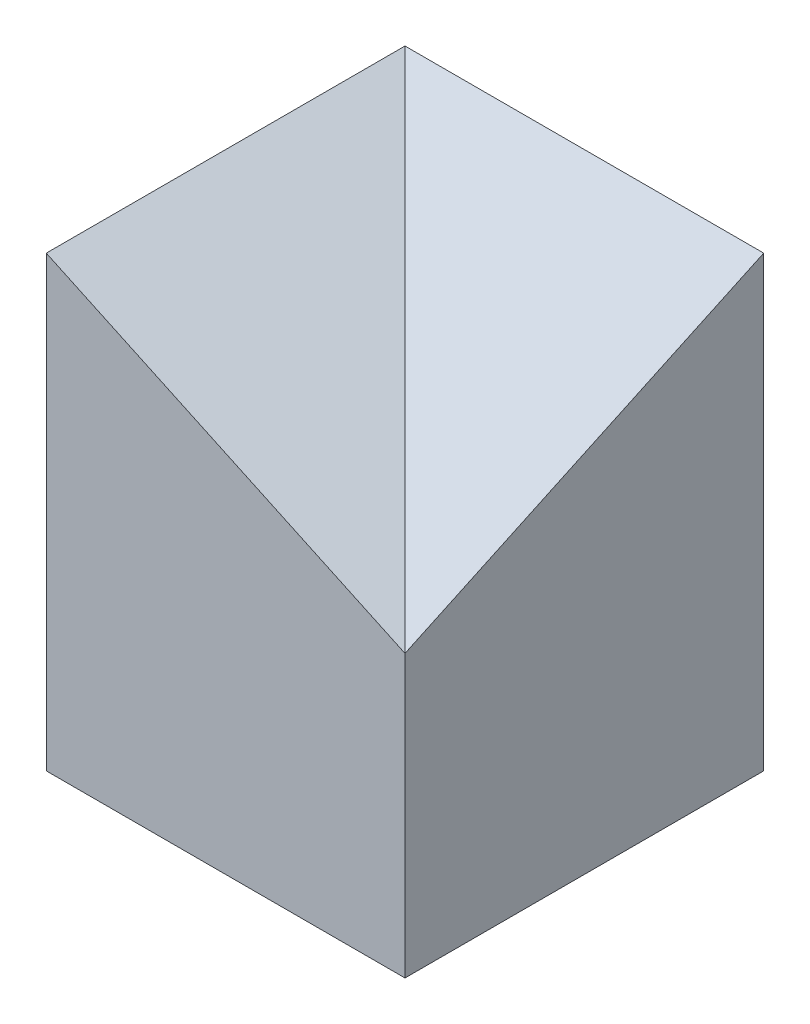
ISO-10303-21;
HEADER;
FILE_DESCRIPTION(('STEP AP214'),'2;1');
FILE_NAME('part.step','',(''),(''),'','','');
FILE_SCHEMA(('AUTOMOTIVE_DESIGN { 1 0 10303 214 1 1 1 1 }'));
ENDSEC;
DATA;
#1=APPLICATION_CONTEXT('core data for automotive mechanical design processes');
#2=APPLICATION_PROTOCOL_DEFINITION('international standard','automotive_design',2000,#1);
#3=PRODUCT_CONTEXT('',#1,'mechanical');
#4=PRODUCT('Part','Part','',(#3));
#5=PRODUCT_RELATED_PRODUCT_CATEGORY('part','',(#4));
#6=PRODUCT_DEFINITION_FORMATION('','',#4);
#7=PRODUCT_DEFINITION_CONTEXT('part definition',#1,'design');
#8=PRODUCT_DEFINITION('design','',#6,#7);
#9=PRODUCT_DEFINITION_SHAPE('','',#8);
#10=(LENGTH_UNIT() NAMED_UNIT(*) SI_UNIT(.MILLI.,.METRE.));
#11=(NAMED_UNIT(*) PLANE_ANGLE_UNIT() SI_UNIT($,.RADIAN.));
#12=(NAMED_UNIT(*) SI_UNIT($,.STERADIAN.) SOLID_ANGLE_UNIT());
#13=UNCERTAINTY_MEASURE_WITH_UNIT(LENGTH_MEASURE(1.E-05),#10,'distance_accuracy_value','');
#14=(GEOMETRIC_REPRESENTATION_CONTEXT(3) GLOBAL_UNCERTAINTY_ASSIGNED_CONTEXT((#13)) GLOBAL_UNIT_ASSIGNED_CONTEXT((#10,
#11,#12)) REPRESENTATION_CONTEXT('',''));
#15=CARTESIAN_POINT('',(0.,0.,0.));
#16=DIRECTION('',(0.,0.,1.));
#17=DIRECTION('',(1.,0.,0.));
#18=AXIS2_PLACEMENT_3D('',#15,#16,#17);
#19=CARTESIAN_POINT('',(400.,500.001,0.));
#20=DIRECTION('',(-1.,0.,0.));
#21=DIRECTION('',(0.,0.,1.));
#22=AXIS2_PLACEMENT_3D('',#19,#20,#21);
#23=PLANE('',#22);
#24=DIRECTION('',(0.,0.422618261740694,-0.906307787036653));
#25=VECTOR('',#24,1.);
#26=CARTESIAN_POINT('',(400.,500.000178606195,-0.000383022221570499));
#27=LINE('',#26,#25);
#28=CARTESIAN_POINT('',(400.,313.476936738004,400.));
#29=VERTEX_POINT('',#28);
#30=CARTESIAN_POINT('',(400.,500.,0.));
#31=VERTEX_POINT('',#30);
#32=EDGE_CURVE('E59',#29,#31,#27,.T.);
#33=ORIENTED_EDGE('',*,*,#32,.F.);
#34=DIRECTION('',(0.,-1.,0.));
#35=VECTOR('',#34,1.);
#36=CARTESIAN_POINT('',(400.,500.001,400.));
#37=LINE('',#36,#35);
#38=CARTESIAN_POINT('',(400.,0.,400.));
#39=VERTEX_POINT('',#38);
#40=EDGE_CURVE('E83',#29,#39,#37,.T.);
#41=ORIENTED_EDGE('',*,*,#40,.T.);
#42=DIRECTION('',(0.,0.,-1.));
#43=VECTOR('',#42,1.);
#44=CARTESIAN_POINT('',(400.,0.,0.));
#45=LINE('',#44,#43);
#46=CARTESIAN_POINT('',(400.,0.,0.));
#47=VERTEX_POINT('',#46);
#48=EDGE_CURVE('E86',#39,#47,#45,.T.);
#49=ORIENTED_EDGE('',*,*,#48,.T.);
#50=DIRECTION('',(0.,-1.,0.));
#51=VECTOR('',#50,1.);
#52=CARTESIAN_POINT('',(400.,500.001,0.));
#53=LINE('',#52,#51);
#54=EDGE_CURVE('E104',#31,#47,#53,.T.);
#55=ORIENTED_EDGE('',*,*,#54,.F.);
#56=EDGE_LOOP('',(#33,#41,#49,#55));
#57=FACE_BOUND('',#56,.T.);
#58=ADVANCED_FACE('F49',(#57),#23,.F.);
#59=CARTESIAN_POINT('',(0.,500.001,0.));
#60=DIRECTION('',(0.,0.,1.));
#61=DIRECTION('',(1.,0.,0.));
#62=AXIS2_PLACEMENT_3D('',#59,#60,#61);
#63=PLANE('',#62);
#64=DIRECTION('',(-1.,0.,0.));
#65=VECTOR('',#64,1.);
#66=CARTESIAN_POINT('',(0.,500.,0.));
#67=LINE('',#66,#65);
#68=CARTESIAN_POINT('',(0.,500.,0.));
#69=VERTEX_POINT('',#68);
#70=EDGE_CURVE('E12',#31,#69,#67,.T.);
#71=ORIENTED_EDGE('',*,*,#70,.F.);
#72=ORIENTED_EDGE('',*,*,#54,.T.);
#73=DIRECTION('',(-1.,0.,0.));
#74=VECTOR('',#73,1.);
#75=CARTESIAN_POINT('',(0.,0.,0.));
#76=LINE('',#75,#74);
#77=CARTESIAN_POINT('',(0.,0.,0.));
#78=VERTEX_POINT('',#77);
#79=EDGE_CURVE('E103',#47,#78,#76,.T.);
#80=ORIENTED_EDGE('',*,*,#79,.T.);
#81=DIRECTION('',(0.,-1.,0.));
#82=VECTOR('',#81,1.);
#83=CARTESIAN_POINT('',(0.,500.001,0.));
#84=LINE('',#83,#82);
#85=EDGE_CURVE('E112',#69,#78,#84,.T.);
#86=ORIENTED_EDGE('',*,*,#85,.F.);
#87=EDGE_LOOP('',(#71,#72,#80,#86));
#88=FACE_BOUND('',#87,.T.);
#89=ADVANCED_FACE('F128',(#88),#63,.F.);
#90=CARTESIAN_POINT('',(0.,500.001,0.));
#91=DIRECTION('',(1.,0.,0.));
#92=DIRECTION('',(0.,0.,-1.));
#93=AXIS2_PLACEMENT_3D('',#90,#91,#92);
#94=PLANE('',#93);
#95=DIRECTION('',(0.,-1.,0.));
#96=VECTOR('',#95,1.);
#97=CARTESIAN_POINT('',(0.,500.001,400.));
#98=LINE('',#97,#96);
#99=CARTESIAN_POINT('',(0.,500.,400.));
#100=VERTEX_POINT('',#99);
#101=CARTESIAN_POINT('',(0.,0.,400.));
#102=VERTEX_POINT('',#101);
#103=EDGE_CURVE('E96',#100,#102,#98,.T.);
#104=ORIENTED_EDGE('',*,*,#103,.F.);
#105=DIRECTION('',(0.,0.,-1.));
#106=VECTOR('',#105,1.);
#107=CARTESIAN_POINT('',(0.,500.,0.));
#108=LINE('',#107,#106);
#109=EDGE_CURVE('E115',#100,#69,#108,.T.);
#110=ORIENTED_EDGE('',*,*,#109,.T.);
#111=ORIENTED_EDGE('',*,*,#85,.T.);
#112=DIRECTION('',(0.,0.,1.));
#113=VECTOR('',#112,1.);
#114=CARTESIAN_POINT('',(0.,0.,0.));
#115=LINE('',#114,#113);
#116=EDGE_CURVE('E109',#78,#102,#115,.T.);
#117=ORIENTED_EDGE('',*,*,#116,.T.);
#118=EDGE_LOOP('',(#104,#110,#111,#117));
#119=FACE_BOUND('',#118,.T.);
#120=ADVANCED_FACE('F126',(#119),#94,.F.);
#121=CARTESIAN_POINT('',(0.,500.001,400.));
#122=DIRECTION('',(0.,0.,-1.));
#123=DIRECTION('',(-1.,0.,0.));
#124=AXIS2_PLACEMENT_3D('',#121,#122,#123);
#125=PLANE('',#124);
#126=ORIENTED_EDGE('',*,*,#40,.F.);
#127=DIRECTION('',(-0.906307787036653,0.422618261740694,0.));
#128=VECTOR('',#127,1.);
#129=CARTESIAN_POINT('',(-0.000383022221532901,500.000178606195,400.));
#130=LINE('',#129,#128);
#131=EDGE_CURVE('E111',#29,#100,#130,.T.);
#132=ORIENTED_EDGE('',*,*,#131,.T.);
#133=ORIENTED_EDGE('',*,*,#103,.T.);
#134=DIRECTION('',(1.,0.,0.));
#135=VECTOR('',#134,1.);
#136=CARTESIAN_POINT('',(0.,0.,400.));
#137=LINE('',#136,#135);
#138=EDGE_CURVE('E93',#102,#39,#137,.T.);
#139=ORIENTED_EDGE('',*,*,#138,.T.);
#140=EDGE_LOOP('',(#126,#132,#133,#139));
#141=FACE_BOUND('',#140,.T.);
#142=ADVANCED_FACE('F94',(#141),#125,.F.);
#143=CARTESIAN_POINT('',(0.,0.,0.));
#144=DIRECTION('',(0.,1.,0.));
#145=DIRECTION('',(0.,0.,1.));
#146=AXIS2_PLACEMENT_3D('',#143,#144,#145);
#147=PLANE('',#146);
#148=ORIENTED_EDGE('',*,*,#116,.F.);
#149=ORIENTED_EDGE('',*,*,#79,.F.);
#150=ORIENTED_EDGE('',*,*,#48,.F.);
#151=ORIENTED_EDGE('',*,*,#138,.F.);
#152=EDGE_LOOP('',(#148,#149,#150,#151));
#153=FACE_BOUND('',#152,.T.);
#154=ADVANCED_FACE('F101',(#153),#147,.F.);
#155=CARTESIAN_POINT('',(0.,500.,0.));
#156=DIRECTION('',(-0.422618261740694,-0.906307787036653,0.));
#157=DIRECTION('',(0.906307787036653,-0.422618261740694,0.));
#158=AXIS2_PLACEMENT_3D('',#155,#156,#157);
#159=PLANE('',#158);
#160=DIRECTION('',(-0.671542934237819,0.313145613014968,-0.671542934237819));
#161=VECTOR('',#160,1.);
#162=CARTESIAN_POINT('',(0.,500.,0.));
#163=LINE('',#162,#161);
#164=EDGE_CURVE('E53',#29,#69,#163,.T.);
#165=ORIENTED_EDGE('',*,*,#164,.T.);
#166=ORIENTED_EDGE('',*,*,#109,.F.);
#167=ORIENTED_EDGE('',*,*,#131,.F.);
#168=EDGE_LOOP('',(#165,#166,#167));
#169=FACE_BOUND('',#168,.T.);
#170=ADVANCED_FACE('F120',(#169),#159,.F.);
#171=CARTESIAN_POINT('',(0.,500.,0.));
#172=DIRECTION('',(0.,0.906307787036653,0.422618261740694));
#173=DIRECTION('',(0.,-0.422618261740694,0.906307787036653));
#174=AXIS2_PLACEMENT_3D('',#171,#172,#173);
#175=PLANE('',#174);
#176=ORIENTED_EDGE('',*,*,#32,.T.);
#177=ORIENTED_EDGE('',*,*,#70,.T.);
#178=ORIENTED_EDGE('',*,*,#164,.F.);
#179=EDGE_LOOP('',(#176,#177,#178));
#180=FACE_BOUND('',#179,.T.);
#181=ADVANCED_FACE('F51',(#180),#175,.T.);
#182=CLOSED_SHELL('',(#58,#89,#120,#142,#154,#170,#181));
#183=MANIFOLD_SOLID_BREP('B2',#182);
#184=ADVANCED_BREP_SHAPE_REPRESENTATION('',(#18,#183),#14);
#185=SHAPE_DEFINITION_REPRESENTATION(#9,#184);
ENDSEC;
END-ISO-10303-21;
